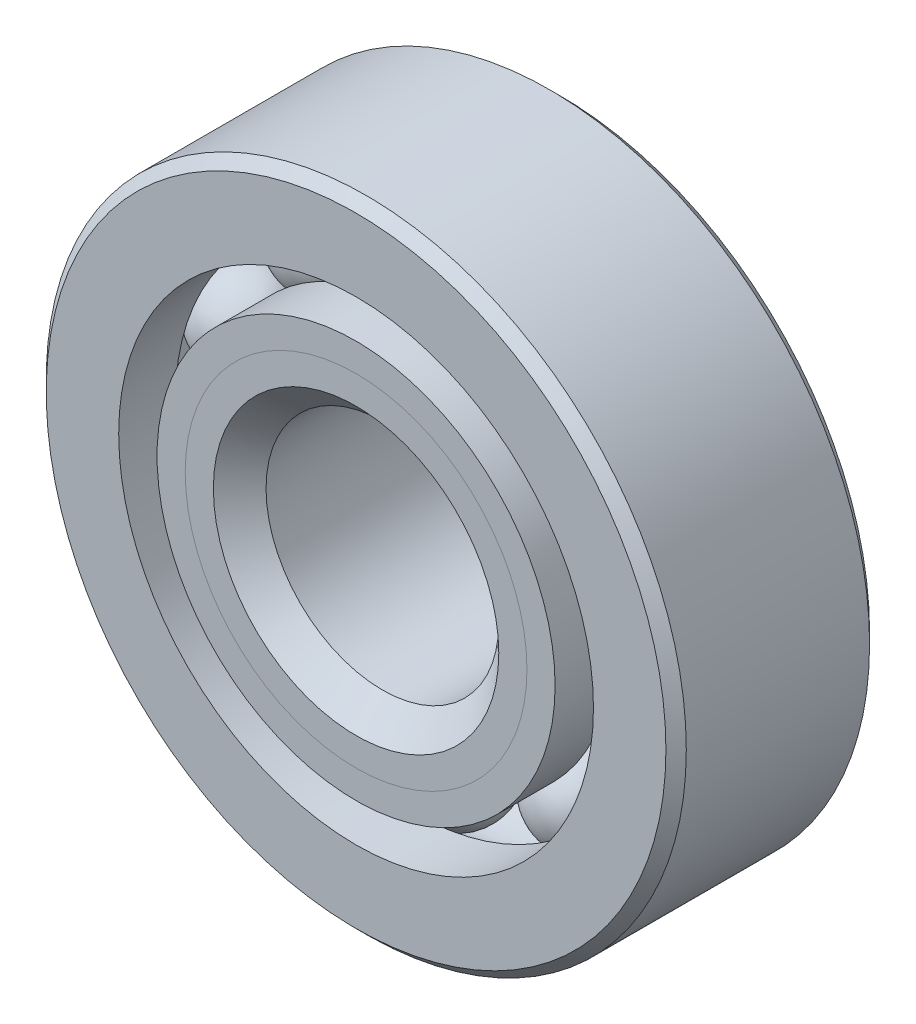
ISO-10303-21;
HEADER;
FILE_DESCRIPTION(('STEP AP214'),'2;1');
FILE_NAME('part.step','',(''),(''),'','','');
FILE_SCHEMA(('AUTOMOTIVE_DESIGN { 1 0 10303 214 1 1 1 1 }'));
ENDSEC;
DATA;
#1=APPLICATION_CONTEXT('core data for automotive mechanical design processes');
#2=APPLICATION_PROTOCOL_DEFINITION('international standard','automotive_design',2000,#1);
#3=PRODUCT_CONTEXT('',#1,'mechanical');
#4=PRODUCT('Part','Part','',(#3));
#5=PRODUCT_RELATED_PRODUCT_CATEGORY('part','',(#4));
#6=PRODUCT_DEFINITION_FORMATION('','',#4);
#7=PRODUCT_DEFINITION_CONTEXT('part definition',#1,'design');
#8=PRODUCT_DEFINITION('design','',#6,#7);
#9=PRODUCT_DEFINITION_SHAPE('','',#8);
#10=(LENGTH_UNIT() NAMED_UNIT(*) SI_UNIT(.MILLI.,.METRE.));
#11=(NAMED_UNIT(*) PLANE_ANGLE_UNIT() SI_UNIT($,.RADIAN.));
#12=(NAMED_UNIT(*) SI_UNIT($,.STERADIAN.) SOLID_ANGLE_UNIT());
#13=UNCERTAINTY_MEASURE_WITH_UNIT(LENGTH_MEASURE(1.E-05),#10,'distance_accuracy_value','');
#14=(GEOMETRIC_REPRESENTATION_CONTEXT(3) GLOBAL_UNCERTAINTY_ASSIGNED_CONTEXT((#13)) GLOBAL_UNIT_ASSIGNED_CONTEXT((#10,
#11,#12)) REPRESENTATION_CONTEXT('',''));
#15=CARTESIAN_POINT('',(0.,0.,0.));
#16=DIRECTION('',(0.,0.,1.));
#17=DIRECTION('',(1.,0.,0.));
#18=AXIS2_PLACEMENT_3D('',#15,#16,#17);
#19=CARTESIAN_POINT('',(-4.40838939219347,6.06762745781216,0.));
#20=DIRECTION('',(0.,0.,1.));
#21=DIRECTION('',(-0.587785252292462,0.809016994374955,0.));
#22=AXIS2_PLACEMENT_3D('',#19,#20,#21);
#23=SPHERICAL_SURFACE('',#22,1.68952158656808);
#24=CARTESIAN_POINT('',(-4.40838939219347,6.06762745781216,1.68952158656808));
#25=VERTEX_POINT('',#24);
#26=VERTEX_LOOP('',#25);
#27=FACE_BOUND('',#26,.T.);
#28=ADVANCED_FACE('F41',(#27),#23,.T.);
#29=CLOSED_SHELL('',(#28));
#30=MANIFOLD_SOLID_BREP('B2',#29);
#31=CARTESIAN_POINT('',(-7.13292387221363,2.31762745781219,0.));
#32=DIRECTION('',(0.,0.,1.));
#33=DIRECTION('',(-0.95105651629515,0.309016994374958,0.));
#34=AXIS2_PLACEMENT_3D('',#31,#32,#33);
#35=SPHERICAL_SURFACE('',#34,1.68952158656808);
#36=CARTESIAN_POINT('',(-7.13292387221363,2.31762745781219,1.68952158656808));
#37=VERTEX_POINT('',#36);
#38=VERTEX_LOOP('',#37);
#39=FACE_BOUND('',#38,.T.);
#40=ADVANCED_FACE('F74',(#39),#35,.T.);
#41=CLOSED_SHELL('',(#40));
#42=MANIFOLD_SOLID_BREP('B6',#41);
#43=CARTESIAN_POINT('',(-7.13292387221367,-2.31762745781204,0.));
#44=DIRECTION('',(0.,0.,1.));
#45=DIRECTION('',(-0.951056516295157,-0.309016994374938,0.));
#46=AXIS2_PLACEMENT_3D('',#43,#44,#45);
#47=SPHERICAL_SURFACE('',#46,1.68952158656808);
#48=CARTESIAN_POINT('',(-7.13292387221367,-2.31762745781204,1.68952158656808));
#49=VERTEX_POINT('',#48);
#50=VERTEX_LOOP('',#49);
#51=FACE_BOUND('',#50,.T.);
#52=ADVANCED_FACE('F107',(#51),#47,.T.);
#53=CLOSED_SHELL('',(#52));
#54=MANIFOLD_SOLID_BREP('B37',#53);
#55=CARTESIAN_POINT('',(-4.4083893921936,-6.06762745781207,0.));
#56=DIRECTION('',(0.,0.,1.));
#57=DIRECTION('',(-0.58778525229248,-0.809016994374942,0.));
#58=AXIS2_PLACEMENT_3D('',#55,#56,#57);
#59=SPHERICAL_SURFACE('',#58,1.68952158656808);
#60=CARTESIAN_POINT('',(-4.4083893921936,-6.06762745781207,1.68952158656808));
#61=VERTEX_POINT('',#60);
#62=VERTEX_LOOP('',#61);
#63=FACE_BOUND('',#62,.T.);
#64=ADVANCED_FACE('F140',(#63),#59,.T.);
#65=CLOSED_SHELL('',(#64));
#66=MANIFOLD_SOLID_BREP('B70',#65);
#67=CARTESIAN_POINT('',(0.,-7.5,0.));
#68=DIRECTION('',(0.,0.,1.));
#69=DIRECTION('',(0.,-1.,0.));
#70=AXIS2_PLACEMENT_3D('',#67,#68,#69);
#71=SPHERICAL_SURFACE('',#70,1.68952158656808);
#72=CARTESIAN_POINT('',(0.,-7.5,1.68952158656808));
#73=VERTEX_POINT('',#72);
#74=VERTEX_LOOP('',#73);
#75=FACE_BOUND('',#74,.T.);
#76=ADVANCED_FACE('F175',(#75),#71,.T.);
#77=CLOSED_SHELL('',(#76));
#78=MANIFOLD_SOLID_BREP('B103',#77);
#79=CARTESIAN_POINT('',(4.40838939219351,-6.06762745781213,0.));
#80=DIRECTION('',(0.,0.,1.));
#81=DIRECTION('',(0.587785252292469,-0.809016994374951,0.));
#82=AXIS2_PLACEMENT_3D('',#79,#80,#81);
#83=SPHERICAL_SURFACE('',#82,1.68952158656808);
#84=CARTESIAN_POINT('',(4.40838939219351,-6.06762745781213,1.68952158656808));
#85=VERTEX_POINT('',#84);
#86=VERTEX_LOOP('',#85);
#87=FACE_BOUND('',#86,.T.);
#88=ADVANCED_FACE('F208',(#87),#83,.T.);
#89=CLOSED_SHELL('',(#88));
#90=MANIFOLD_SOLID_BREP('B136',#89);
#91=CARTESIAN_POINT('',(7.13292387221364,-2.31762745781214,0.));
#92=DIRECTION('',(0.,0.,1.));
#93=DIRECTION('',(0.951056516295152,-0.309016994374952,0.));
#94=AXIS2_PLACEMENT_3D('',#91,#92,#93);
#95=SPHERICAL_SURFACE('',#94,1.68952158656808);
#96=CARTESIAN_POINT('',(7.13292387221364,-2.31762745781214,1.68952158656808));
#97=VERTEX_POINT('',#96);
#98=VERTEX_LOOP('',#97);
#99=FACE_BOUND('',#98,.T.);
#100=ADVANCED_FACE('F241',(#99),#95,.T.);
#101=CLOSED_SHELL('',(#100));
#102=MANIFOLD_SOLID_BREP('B171',#101);
#103=CARTESIAN_POINT('',(7.13292387221366,2.31762745781209,0.));
#104=DIRECTION('',(0.,0.,1.));
#105=DIRECTION('',(0.951056516295155,0.309016994374945,0.));
#106=AXIS2_PLACEMENT_3D('',#103,#104,#105);
#107=SPHERICAL_SURFACE('',#106,1.68952158656808);
#108=CARTESIAN_POINT('',(7.13292387221366,2.31762745781209,1.68952158656808));
#109=VERTEX_POINT('',#108);
#110=VERTEX_LOOP('',#109);
#111=FACE_BOUND('',#110,.T.);
#112=ADVANCED_FACE('F274',(#111),#107,.T.);
#113=CLOSED_SHELL('',(#112));
#114=MANIFOLD_SOLID_BREP('B204',#113);
#115=CARTESIAN_POINT('',(4.40838939219356,6.0676274578121,0.));
#116=DIRECTION('',(0.,0.,1.));
#117=DIRECTION('',(0.587785252292474,0.809016994374947,0.));
#118=AXIS2_PLACEMENT_3D('',#115,#116,#117);
#119=SPHERICAL_SURFACE('',#118,1.68952158656808);
#120=CARTESIAN_POINT('',(4.40838939219356,6.0676274578121,1.68952158656808));
#121=VERTEX_POINT('',#120);
#122=VERTEX_LOOP('',#121);
#123=FACE_BOUND('',#122,.T.);
#124=ADVANCED_FACE('F307',(#123),#119,.T.);
#125=CLOSED_SHELL('',(#124));
#126=MANIFOLD_SOLID_BREP('B237',#125);
#127=CARTESIAN_POINT('',(0.,7.5,0.));
#128=DIRECTION('',(0.,0.,1.));
#129=DIRECTION('',(0.,1.,0.));
#130=AXIS2_PLACEMENT_3D('',#127,#128,#129);
#131=SPHERICAL_SURFACE('',#130,1.68952158656808);
#132=CARTESIAN_POINT('',(0.,7.5,1.68952158656808));
#133=VERTEX_POINT('',#132);
#134=VERTEX_LOOP('',#133);
#135=FACE_BOUND('',#134,.T.);
#136=ADVANCED_FACE('F344',(#135),#131,.T.);
#137=CLOSED_SHELL('',(#136));
#138=MANIFOLD_SOLID_BREP('B270',#137);
#139=CARTESIAN_POINT('',(0.,5.87294927368765,3.5));
#140=DIRECTION('',(0.,0.,-1.));
#141=DIRECTION('',(-1.,0.,0.));
#142=AXIS2_PLACEMENT_3D('',#139,#140,#141);
#143=PLANE('',#142);
#144=CARTESIAN_POINT('',(0.,0.,3.5));
#145=DIRECTION('',(0.,0.,1.));
#146=DIRECTION('',(1.,0.,0.));
#147=AXIS2_PLACEMENT_3D('',#144,#145,#146);
#148=CIRCLE('',#147,4.90523920671596);
#149=CARTESIAN_POINT('',(4.90523920671596,0.,3.5));
#150=VERTEX_POINT('',#149);
#151=EDGE_CURVE('E398',#150,#150,#148,.T.);
#152=ORIENTED_EDGE('',*,*,#151,.F.);
#153=EDGE_LOOP('',(#152));
#154=FACE_BOUND('',#153,.T.);
#155=CARTESIAN_POINT('',(0.,0.,3.5));
#156=DIRECTION('',(0.,0.,1.));
#157=DIRECTION('',(1.,0.,0.));
#158=AXIS2_PLACEMENT_3D('',#155,#156,#157);
#159=CIRCLE('',#158,5.87294927368765);
#160=CARTESIAN_POINT('',(5.87294927368765,0.,3.5));
#161=VERTEX_POINT('',#160);
#162=EDGE_CURVE('E343',#161,#161,#159,.T.);
#163=ORIENTED_EDGE('',*,*,#162,.T.);
#164=EDGE_LOOP('',(#163));
#165=FACE_BOUND('',#164,.T.);
#166=ADVANCED_FACE('F364',(#154,#165),#143,.F.);
#167=CARTESIAN_POINT('',(0.,0.,2.53228993302831));
#168=DIRECTION('',(0.,0.,1.));
#169=DIRECTION('',(1.,0.,0.));
#170=AXIS2_PLACEMENT_3D('',#167,#168,#169);
#171=CONICAL_SURFACE('',#170,4.90523920671596,0.78539816339745);
#172=ORIENTED_EDGE('',*,*,#162,.F.);
#173=EDGE_LOOP('',(#172));
#174=FACE_BOUND('',#173,.T.);
#175=CARTESIAN_POINT('',(0.,0.,2.53228993302831));
#176=DIRECTION('',(0.,0.,1.));
#177=DIRECTION('',(1.,0.,0.));
#178=AXIS2_PLACEMENT_3D('',#175,#176,#177);
#179=CIRCLE('',#178,4.90523920671596);
#180=CARTESIAN_POINT('',(4.90523920671596,0.,2.53228993302831));
#181=VERTEX_POINT('',#180);
#182=EDGE_CURVE('E370',#181,#181,#179,.T.);
#183=ORIENTED_EDGE('',*,*,#182,.T.);
#184=EDGE_LOOP('',(#183));
#185=FACE_BOUND('',#184,.T.);
#186=ADVANCED_FACE('F405',(#174,#185),#171,.T.);
#187=CARTESIAN_POINT('',(0.,0.,3.5));
#188=DIRECTION('',(0.,0.,1.));
#189=DIRECTION('',(1.,0.,0.));
#190=AXIS2_PLACEMENT_3D('',#187,#188,#189);
#191=CYLINDRICAL_SURFACE('',#190,4.90523920671596);
#192=ORIENTED_EDGE('',*,*,#182,.F.);
#193=EDGE_LOOP('',(#192));
#194=FACE_BOUND('',#193,.T.);
#195=CARTESIAN_POINT('',(0.,0.,0.));
#196=DIRECTION('',(0.,0.,1.));
#197=DIRECTION('',(1.,0.,0.));
#198=AXIS2_PLACEMENT_3D('',#195,#196,#197);
#199=CIRCLE('',#198,4.90523920671596);
#200=CARTESIAN_POINT('',(4.90523920671596,0.,0.));
#201=VERTEX_POINT('',#200);
#202=EDGE_CURVE('E374',#201,#201,#199,.T.);
#203=ORIENTED_EDGE('',*,*,#202,.T.);
#204=EDGE_LOOP('',(#203));
#205=FACE_BOUND('',#204,.T.);
#206=ADVANCED_FACE('F409',(#194,#205),#191,.T.);
#207=CARTESIAN_POINT('',(0.,4.90523920671596,0.));
#208=DIRECTION('',(0.,0.,-1.));
#209=DIRECTION('',(-1.,0.,0.));
#210=AXIS2_PLACEMENT_3D('',#207,#208,#209);
#211=PLANE('',#210);
#212=ORIENTED_EDGE('',*,*,#202,.F.);
#213=EDGE_LOOP('',(#212));
#214=FACE_BOUND('',#213,.T.);
#215=CARTESIAN_POINT('',(0.,0.,0.));
#216=DIRECTION('',(0.,0.,1.));
#217=DIRECTION('',(1.,0.,0.));
#218=AXIS2_PLACEMENT_3D('',#215,#216,#217);
#219=CIRCLE('',#218,5.81047841343192);
#220=CARTESIAN_POINT('',(5.81047841343192,0.,0.));
#221=VERTEX_POINT('',#220);
#222=EDGE_CURVE('E378',#221,#221,#219,.T.);
#223=ORIENTED_EDGE('',*,*,#222,.T.);
#224=EDGE_LOOP('',(#223));
#225=FACE_BOUND('',#224,.T.);
#226=ADVANCED_FACE('F414',(#214,#225),#211,.F.);
#227=CARTESIAN_POINT('',(0.,0.,0.));
#228=DIRECTION('',(0.,0.,1.));
#229=DIRECTION('',(1.,0.,0.));
#230=AXIS2_PLACEMENT_3D('',#227,#228,#229);
#231=TOROIDAL_SURFACE('',#230,7.5,1.68952158656808);
#232=ORIENTED_EDGE('',*,*,#222,.F.);
#233=EDGE_LOOP('',(#232));
#234=FACE_BOUND('',#233,.T.);
#235=CARTESIAN_POINT('',(0.,0.,-1.55555555555556));
#236=DIRECTION('',(0.,0.,1.));
#237=DIRECTION('',(1.,0.,0.));
#238=AXIS2_PLACEMENT_3D('',#235,#236,#237);
#239=CIRCLE('',#238,6.84065934065934);
#240=CARTESIAN_POINT('',(6.84065934065934,0.,-1.55555555555556));
#241=VERTEX_POINT('',#240);
#242=EDGE_CURVE('E383',#241,#241,#239,.T.);
#243=ORIENTED_EDGE('',*,*,#242,.T.);
#244=EDGE_LOOP('',(#243));
#245=FACE_BOUND('',#244,.T.);
#246=ADVANCED_FACE('F420',(#234,#245),#231,.F.);
#247=CARTESIAN_POINT('',(0.,0.,3.5));
#248=DIRECTION('',(0.,0.,1.));
#249=DIRECTION('',(1.,0.,0.));
#250=AXIS2_PLACEMENT_3D('',#247,#248,#249);
#251=CYLINDRICAL_SURFACE('',#250,6.84065934065934);
#252=ORIENTED_EDGE('',*,*,#242,.F.);
#253=EDGE_LOOP('',(#252));
#254=FACE_BOUND('',#253,.T.);
#255=CARTESIAN_POINT('',(0.,0.,-3.5));
#256=DIRECTION('',(0.,0.,1.));
#257=DIRECTION('',(1.,0.,0.));
#258=AXIS2_PLACEMENT_3D('',#255,#256,#257);
#259=CIRCLE('',#258,6.84065934065934);
#260=CARTESIAN_POINT('',(6.84065934065934,0.,-3.5));
#261=VERTEX_POINT('',#260);
#262=EDGE_CURVE('E386',#261,#261,#259,.T.);
#263=ORIENTED_EDGE('',*,*,#262,.T.);
#264=EDGE_LOOP('',(#263));
#265=FACE_BOUND('',#264,.T.);
#266=ADVANCED_FACE('F424',(#254,#265),#251,.T.);
#267=CARTESIAN_POINT('',(0.,4.35,-3.5));
#268=DIRECTION('',(0.,0.,1.));
#269=DIRECTION('',(1.,0.,0.));
#270=AXIS2_PLACEMENT_3D('',#267,#268,#269);
#271=PLANE('',#270);
#272=ORIENTED_EDGE('',*,*,#262,.F.);
#273=EDGE_LOOP('',(#272));
#274=FACE_BOUND('',#273,.T.);
#275=CARTESIAN_POINT('',(0.,0.,-3.5));
#276=DIRECTION('',(0.,0.,1.));
#277=DIRECTION('',(1.,0.,0.));
#278=AXIS2_PLACEMENT_3D('',#275,#276,#277);
#279=CIRCLE('',#278,4.35);
#280=CARTESIAN_POINT('',(4.35,0.,-3.5));
#281=VERTEX_POINT('',#280);
#282=EDGE_CURVE('E389',#281,#281,#279,.T.);
#283=ORIENTED_EDGE('',*,*,#282,.T.);
#284=EDGE_LOOP('',(#283));
#285=FACE_BOUND('',#284,.T.);
#286=ADVANCED_FACE('F428',(#274,#285),#271,.F.);
#287=CARTESIAN_POINT('',(0.,0.,-3.15));
#288=DIRECTION('',(0.,0.,-1.));
#289=DIRECTION('',(-1.,0.,0.));
#290=AXIS2_PLACEMENT_3D('',#287,#288,#289);
#291=CONICAL_SURFACE('',#290,4.,0.785398163397448);
#292=ORIENTED_EDGE('',*,*,#282,.F.);
#293=EDGE_LOOP('',(#292));
#294=FACE_BOUND('',#293,.T.);
#295=CARTESIAN_POINT('',(0.,0.,-3.15));
#296=DIRECTION('',(0.,0.,1.));
#297=DIRECTION('',(1.,0.,0.));
#298=AXIS2_PLACEMENT_3D('',#295,#296,#297);
#299=CIRCLE('',#298,4.);
#300=CARTESIAN_POINT('',(4.,0.,-3.15));
#301=VERTEX_POINT('',#300);
#302=EDGE_CURVE('E392',#301,#301,#299,.T.);
#303=ORIENTED_EDGE('',*,*,#302,.T.);
#304=EDGE_LOOP('',(#303));
#305=FACE_BOUND('',#304,.T.);
#306=ADVANCED_FACE('F432',(#294,#305),#291,.F.);
#307=CARTESIAN_POINT('',(0.,0.,3.5));
#308=DIRECTION('',(0.,0.,1.));
#309=DIRECTION('',(1.,0.,0.));
#310=AXIS2_PLACEMENT_3D('',#307,#308,#309);
#311=CYLINDRICAL_SURFACE('',#310,4.);
#312=ORIENTED_EDGE('',*,*,#302,.F.);
#313=EDGE_LOOP('',(#312));
#314=FACE_BOUND('',#313,.T.);
#315=CARTESIAN_POINT('',(0.,0.,2.59476079328405));
#316=DIRECTION('',(0.,0.,1.));
#317=DIRECTION('',(1.,0.,0.));
#318=AXIS2_PLACEMENT_3D('',#315,#316,#317);
#319=CIRCLE('',#318,4.);
#320=CARTESIAN_POINT('',(4.,0.,2.59476079328405));
#321=VERTEX_POINT('',#320);
#322=EDGE_CURVE('E395',#321,#321,#319,.T.);
#323=ORIENTED_EDGE('',*,*,#322,.T.);
#324=EDGE_LOOP('',(#323));
#325=FACE_BOUND('',#324,.T.);
#326=ADVANCED_FACE('F436',(#314,#325),#311,.F.);
#327=CARTESIAN_POINT('',(0.,0.,3.5));
#328=DIRECTION('',(0.,0.,1.));
#329=DIRECTION('',(1.,0.,0.));
#330=AXIS2_PLACEMENT_3D('',#327,#328,#329);
#331=CONICAL_SURFACE('',#330,4.90523920671596,0.78539816339745);
#332=ORIENTED_EDGE('',*,*,#322,.F.);
#333=EDGE_LOOP('',(#332));
#334=FACE_BOUND('',#333,.T.);
#335=ORIENTED_EDGE('',*,*,#151,.T.);
#336=EDGE_LOOP('',(#335));
#337=FACE_BOUND('',#336,.T.);
#338=ADVANCED_FACE('F402',(#334,#337),#331,.F.);
#339=CLOSED_SHELL('',(#166,#186,#206,#226,#246,#266,#286,#306,#326,#338));
#340=MANIFOLD_SOLID_BREP('B303',#339);
#341=CARTESIAN_POINT('',(0.,6.84065934065934,3.5));
#342=DIRECTION('',(0.,0.,-1.));
#343=DIRECTION('',(-1.,0.,0.));
#344=AXIS2_PLACEMENT_3D('',#341,#342,#343);
#345=PLANE('',#344);
#346=CARTESIAN_POINT('',(0.,0.,3.5));
#347=DIRECTION('',(0.,0.,1.));
#348=DIRECTION('',(1.,0.,0.));
#349=AXIS2_PLACEMENT_3D('',#346,#347,#348);
#350=CIRCLE('',#349,5.87294927368765);
#351=CARTESIAN_POINT('',(5.87294927368765,0.,3.5));
#352=VERTEX_POINT('',#351);
#353=EDGE_CURVE('E363',#352,#352,#350,.T.);
#354=ORIENTED_EDGE('',*,*,#353,.F.);
#355=EDGE_LOOP('',(#354));
#356=FACE_BOUND('',#355,.T.);
#357=CARTESIAN_POINT('',(0.,0.,3.5));
#358=DIRECTION('',(0.,0.,1.));
#359=DIRECTION('',(1.,0.,0.));
#360=AXIS2_PLACEMENT_3D('',#357,#358,#359);
#361=CIRCLE('',#360,6.84065934065934);
#362=CARTESIAN_POINT('',(6.84065934065934,0.,3.5));
#363=VERTEX_POINT('',#362);
#364=EDGE_CURVE('E544',#363,#363,#361,.T.);
#365=ORIENTED_EDGE('',*,*,#364,.T.);
#366=EDGE_LOOP('',(#365));
#367=FACE_BOUND('',#366,.T.);
#368=ADVANCED_FACE('F522',(#356,#367),#345,.F.);
#369=CARTESIAN_POINT('',(0.,0.,3.5));
#370=DIRECTION('',(0.,0.,1.));
#371=DIRECTION('',(1.,0.,0.));
#372=AXIS2_PLACEMENT_3D('',#369,#370,#371);
#373=CONICAL_SURFACE('',#372,5.87294927368765,0.78539816339745);
#374=CARTESIAN_POINT('',(0.,0.,2.53228993302831));
#375=DIRECTION('',(0.,0.,1.));
#376=DIRECTION('',(1.,0.,0.));
#377=AXIS2_PLACEMENT_3D('',#374,#375,#376);
#378=CIRCLE('',#377,4.90523920671596);
#379=CARTESIAN_POINT('',(4.90523920671596,0.,2.53228993302831));
#380=VERTEX_POINT('',#379);
#381=EDGE_CURVE('E528',#380,#380,#378,.T.);
#382=ORIENTED_EDGE('',*,*,#381,.F.);
#383=EDGE_LOOP('',(#382));
#384=FACE_BOUND('',#383,.T.);
#385=ORIENTED_EDGE('',*,*,#353,.T.);
#386=EDGE_LOOP('',(#385));
#387=FACE_BOUND('',#386,.T.);
#388=ADVANCED_FACE('F569',(#384,#387),#373,.F.);
#389=CARTESIAN_POINT('',(0.,0.,3.5));
#390=DIRECTION('',(0.,0.,1.));
#391=DIRECTION('',(1.,0.,0.));
#392=AXIS2_PLACEMENT_3D('',#389,#390,#391);
#393=CYLINDRICAL_SURFACE('',#392,4.90523920671596);
#394=CARTESIAN_POINT('',(0.,0.,0.));
#395=DIRECTION('',(0.,0.,1.));
#396=DIRECTION('',(1.,0.,0.));
#397=AXIS2_PLACEMENT_3D('',#394,#395,#396);
#398=CIRCLE('',#397,4.90523920671596);
#399=CARTESIAN_POINT('',(4.90523920671596,0.,0.));
#400=VERTEX_POINT('',#399);
#401=EDGE_CURVE('E532',#400,#400,#398,.T.);
#402=ORIENTED_EDGE('',*,*,#401,.F.);
#403=EDGE_LOOP('',(#402));
#404=FACE_BOUND('',#403,.T.);
#405=ORIENTED_EDGE('',*,*,#381,.T.);
#406=EDGE_LOOP('',(#405));
#407=FACE_BOUND('',#406,.T.);
#408=ADVANCED_FACE('F564',(#404,#407),#393,.F.);
#409=CARTESIAN_POINT('',(0.,4.90523920671596,0.));
#410=DIRECTION('',(0.,0.,1.));
#411=DIRECTION('',(1.,0.,0.));
#412=AXIS2_PLACEMENT_3D('',#409,#410,#411);
#413=PLANE('',#412);
#414=CARTESIAN_POINT('',(0.,0.,0.));
#415=DIRECTION('',(0.,0.,1.));
#416=DIRECTION('',(1.,0.,0.));
#417=AXIS2_PLACEMENT_3D('',#414,#415,#416);
#418=CIRCLE('',#417,5.81047841343192);
#419=CARTESIAN_POINT('',(5.81047841343192,0.,0.));
#420=VERTEX_POINT('',#419);
#421=EDGE_CURVE('E536',#420,#420,#418,.T.);
#422=ORIENTED_EDGE('',*,*,#421,.F.);
#423=EDGE_LOOP('',(#422));
#424=FACE_BOUND('',#423,.T.);
#425=ORIENTED_EDGE('',*,*,#401,.T.);
#426=EDGE_LOOP('',(#425));
#427=FACE_BOUND('',#426,.T.);
#428=ADVANCED_FACE('F558',(#424,#427),#413,.F.);
#429=CARTESIAN_POINT('',(0.,0.,0.));
#430=DIRECTION('',(0.,0.,1.));
#431=DIRECTION('',(1.,0.,0.));
#432=AXIS2_PLACEMENT_3D('',#429,#430,#431);
#433=TOROIDAL_SURFACE('',#432,7.5,1.68952158656808);
#434=CARTESIAN_POINT('',(0.,0.,1.55555555555555));
#435=DIRECTION('',(0.,0.,1.));
#436=DIRECTION('',(1.,0.,0.));
#437=AXIS2_PLACEMENT_3D('',#434,#435,#436);
#438=CIRCLE('',#437,6.84065934065934);
#439=CARTESIAN_POINT('',(6.84065934065934,0.,1.55555555555555));
#440=VERTEX_POINT('',#439);
#441=EDGE_CURVE('E541',#440,#440,#438,.T.);
#442=ORIENTED_EDGE('',*,*,#441,.F.);
#443=EDGE_LOOP('',(#442));
#444=FACE_BOUND('',#443,.T.);
#445=ORIENTED_EDGE('',*,*,#421,.T.);
#446=EDGE_LOOP('',(#445));
#447=FACE_BOUND('',#446,.T.);
#448=ADVANCED_FACE('F552',(#444,#447),#433,.F.);
#449=CARTESIAN_POINT('',(0.,0.,3.5));
#450=DIRECTION('',(0.,0.,1.));
#451=DIRECTION('',(1.,0.,0.));
#452=AXIS2_PLACEMENT_3D('',#449,#450,#451);
#453=CYLINDRICAL_SURFACE('',#452,6.84065934065934);
#454=ORIENTED_EDGE('',*,*,#364,.F.);
#455=EDGE_LOOP('',(#454));
#456=FACE_BOUND('',#455,.T.);
#457=ORIENTED_EDGE('',*,*,#441,.T.);
#458=EDGE_LOOP('',(#457));
#459=FACE_BOUND('',#458,.T.);
#460=ADVANCED_FACE('F549',(#456,#459),#453,.T.);
#461=CLOSED_SHELL('',(#368,#388,#408,#428,#448,#460));
#462=MANIFOLD_SOLID_BREP('B338',#461);
#463=CARTESIAN_POINT('',(0.,0.,3.15));
#464=DIRECTION('',(0.,0.,-1.));
#465=DIRECTION('',(-1.,0.,0.));
#466=AXIS2_PLACEMENT_3D('',#463,#464,#465);
#467=CONICAL_SURFACE('',#466,11.,0.785398163397448);
#468=CARTESIAN_POINT('',(0.,0.,3.5));
#469=DIRECTION('',(0.,0.,1.));
#470=DIRECTION('',(1.,0.,0.));
#471=AXIS2_PLACEMENT_3D('',#468,#469,#470);
#472=CIRCLE('',#471,10.65);
#473=CARTESIAN_POINT('',(10.65,0.,3.5));
#474=VERTEX_POINT('',#473);
#475=EDGE_CURVE('E641',#474,#474,#472,.T.);
#476=ORIENTED_EDGE('',*,*,#475,.F.);
#477=EDGE_LOOP('',(#476));
#478=FACE_BOUND('',#477,.T.);
#479=CARTESIAN_POINT('',(0.,0.,3.15));
#480=DIRECTION('',(0.,0.,1.));
#481=DIRECTION('',(1.,0.,0.));
#482=AXIS2_PLACEMENT_3D('',#479,#480,#481);
#483=CIRCLE('',#482,11.);
#484=CARTESIAN_POINT('',(11.,0.,3.15));
#485=VERTEX_POINT('',#484);
#486=EDGE_CURVE('E521',#485,#485,#483,.T.);
#487=ORIENTED_EDGE('',*,*,#486,.T.);
#488=EDGE_LOOP('',(#487));
#489=FACE_BOUND('',#488,.T.);
#490=ADVANCED_FACE('F613',(#478,#489),#467,.T.);
#491=CARTESIAN_POINT('',(0.,0.,3.5));
#492=DIRECTION('',(0.,0.,1.));
#493=DIRECTION('',(1.,0.,0.));
#494=AXIS2_PLACEMENT_3D('',#491,#492,#493);
#495=CYLINDRICAL_SURFACE('',#494,11.);
#496=ORIENTED_EDGE('',*,*,#486,.F.);
#497=EDGE_LOOP('',(#496));
#498=FACE_BOUND('',#497,.T.);
#499=CARTESIAN_POINT('',(0.,0.,-3.15));
#500=DIRECTION('',(0.,0.,1.));
#501=DIRECTION('',(1.,0.,0.));
#502=AXIS2_PLACEMENT_3D('',#499,#500,#501);
#503=CIRCLE('',#502,11.);
#504=CARTESIAN_POINT('',(11.,0.,-3.15));
#505=VERTEX_POINT('',#504);
#506=EDGE_CURVE('E619',#505,#505,#503,.T.);
#507=ORIENTED_EDGE('',*,*,#506,.T.);
#508=EDGE_LOOP('',(#507));
#509=FACE_BOUND('',#508,.T.);
#510=ADVANCED_FACE('F648',(#498,#509),#495,.T.);
#511=CARTESIAN_POINT('',(0.,0.,-3.5));
#512=DIRECTION('',(0.,0.,1.));
#513=DIRECTION('',(1.,0.,0.));
#514=AXIS2_PLACEMENT_3D('',#511,#512,#513);
#515=CONICAL_SURFACE('',#514,10.65,0.785398163397447);
#516=ORIENTED_EDGE('',*,*,#506,.F.);
#517=EDGE_LOOP('',(#516));
#518=FACE_BOUND('',#517,.T.);
#519=CARTESIAN_POINT('',(0.,0.,-3.5));
#520=DIRECTION('',(0.,0.,1.));
#521=DIRECTION('',(1.,0.,0.));
#522=AXIS2_PLACEMENT_3D('',#519,#520,#521);
#523=CIRCLE('',#522,10.65);
#524=CARTESIAN_POINT('',(10.65,0.,-3.5));
#525=VERTEX_POINT('',#524);
#526=EDGE_CURVE('E623',#525,#525,#523,.T.);
#527=ORIENTED_EDGE('',*,*,#526,.T.);
#528=EDGE_LOOP('',(#527));
#529=FACE_BOUND('',#528,.T.);
#530=ADVANCED_FACE('F652',(#518,#529),#515,.T.);
#531=CARTESIAN_POINT('',(0.,10.65,-3.5));
#532=DIRECTION('',(0.,0.,1.));
#533=DIRECTION('',(1.,0.,0.));
#534=AXIS2_PLACEMENT_3D('',#531,#532,#533);
#535=PLANE('',#534);
#536=ORIENTED_EDGE('',*,*,#526,.F.);
#537=EDGE_LOOP('',(#536));
#538=FACE_BOUND('',#537,.T.);
#539=CARTESIAN_POINT('',(0.,0.,-3.5));
#540=DIRECTION('',(0.,0.,1.));
#541=DIRECTION('',(1.,0.,0.));
#542=AXIS2_PLACEMENT_3D('',#539,#540,#541);
#543=CIRCLE('',#542,8.15934065934066);
#544=CARTESIAN_POINT('',(8.15934065934066,0.,-3.5));
#545=VERTEX_POINT('',#544);
#546=EDGE_CURVE('E627',#545,#545,#543,.T.);
#547=ORIENTED_EDGE('',*,*,#546,.T.);
#548=EDGE_LOOP('',(#547));
#549=FACE_BOUND('',#548,.T.);
#550=ADVANCED_FACE('F657',(#538,#549),#535,.F.);
#551=CARTESIAN_POINT('',(0.,0.,3.5));
#552=DIRECTION('',(0.,0.,1.));
#553=DIRECTION('',(1.,0.,0.));
#554=AXIS2_PLACEMENT_3D('',#551,#552,#553);
#555=CYLINDRICAL_SURFACE('',#554,8.15934065934066);
#556=ORIENTED_EDGE('',*,*,#546,.F.);
#557=EDGE_LOOP('',(#556));
#558=FACE_BOUND('',#557,.T.);
#559=CARTESIAN_POINT('',(0.,0.,-1.55555555555556));
#560=DIRECTION('',(0.,0.,1.));
#561=DIRECTION('',(1.,0.,0.));
#562=AXIS2_PLACEMENT_3D('',#559,#560,#561);
#563=CIRCLE('',#562,8.15934065934066);
#564=CARTESIAN_POINT('',(8.15934065934066,0.,-1.55555555555556));
#565=VERTEX_POINT('',#564);
#566=EDGE_CURVE('E632',#565,#565,#563,.T.);
#567=ORIENTED_EDGE('',*,*,#566,.T.);
#568=EDGE_LOOP('',(#567));
#569=FACE_BOUND('',#568,.T.);
#570=ADVANCED_FACE('F663',(#558,#569),#555,.F.);
#571=CARTESIAN_POINT('',(0.,0.,0.));
#572=DIRECTION('',(0.,0.,1.));
#573=DIRECTION('',(1.,0.,0.));
#574=AXIS2_PLACEMENT_3D('',#571,#572,#573);
#575=TOROIDAL_SURFACE('',#574,7.5,1.68952158656808);
#576=ORIENTED_EDGE('',*,*,#566,.F.);
#577=EDGE_LOOP('',(#576));
#578=FACE_BOUND('',#577,.T.);
#579=CARTESIAN_POINT('',(0.,0.,1.55555555555555));
#580=DIRECTION('',(0.,0.,1.));
#581=DIRECTION('',(1.,0.,0.));
#582=AXIS2_PLACEMENT_3D('',#579,#580,#581);
#583=CIRCLE('',#582,8.15934065934066);
#584=CARTESIAN_POINT('',(8.15934065934066,0.,1.55555555555555));
#585=VERTEX_POINT('',#584);
#586=EDGE_CURVE('E635',#585,#585,#583,.T.);
#587=ORIENTED_EDGE('',*,*,#586,.T.);
#588=EDGE_LOOP('',(#587));
#589=FACE_BOUND('',#588,.T.);
#590=ADVANCED_FACE('F667',(#578,#589),#575,.F.);
#591=CARTESIAN_POINT('',(0.,0.,3.5));
#592=DIRECTION('',(0.,0.,1.));
#593=DIRECTION('',(1.,0.,0.));
#594=AXIS2_PLACEMENT_3D('',#591,#592,#593);
#595=CYLINDRICAL_SURFACE('',#594,8.15934065934066);
#596=ORIENTED_EDGE('',*,*,#586,.F.);
#597=EDGE_LOOP('',(#596));
#598=FACE_BOUND('',#597,.T.);
#599=CARTESIAN_POINT('',(0.,0.,3.5));
#600=DIRECTION('',(0.,0.,1.));
#601=DIRECTION('',(1.,0.,0.));
#602=AXIS2_PLACEMENT_3D('',#599,#600,#601);
#603=CIRCLE('',#602,8.15934065934066);
#604=CARTESIAN_POINT('',(8.15934065934066,0.,3.5));
#605=VERTEX_POINT('',#604);
#606=EDGE_CURVE('E638',#605,#605,#603,.T.);
#607=ORIENTED_EDGE('',*,*,#606,.T.);
#608=EDGE_LOOP('',(#607));
#609=FACE_BOUND('',#608,.T.);
#610=ADVANCED_FACE('F671',(#598,#609),#595,.F.);
#611=CARTESIAN_POINT('',(0.,10.65,3.5));
#612=DIRECTION('',(0.,0.,-1.));
#613=DIRECTION('',(-1.,0.,0.));
#614=AXIS2_PLACEMENT_3D('',#611,#612,#613);
#615=PLANE('',#614);
#616=ORIENTED_EDGE('',*,*,#606,.F.);
#617=EDGE_LOOP('',(#616));
#618=FACE_BOUND('',#617,.T.);
#619=ORIENTED_EDGE('',*,*,#475,.T.);
#620=EDGE_LOOP('',(#619));
#621=FACE_BOUND('',#620,.T.);
#622=ADVANCED_FACE('F645',(#618,#621),#615,.F.);
#623=CLOSED_SHELL('',(#490,#510,#530,#550,#570,#590,#610,#622));
#624=MANIFOLD_SOLID_BREP('B358',#623);
#625=ADVANCED_BREP_SHAPE_REPRESENTATION('',(#18,#30,#42,#54,#66,#78,#90,#102,#114,#126,#138,
#340,#462,#624),#14);
#626=SHAPE_DEFINITION_REPRESENTATION(#9,#625);
ENDSEC;
END-ISO-10303-21;
